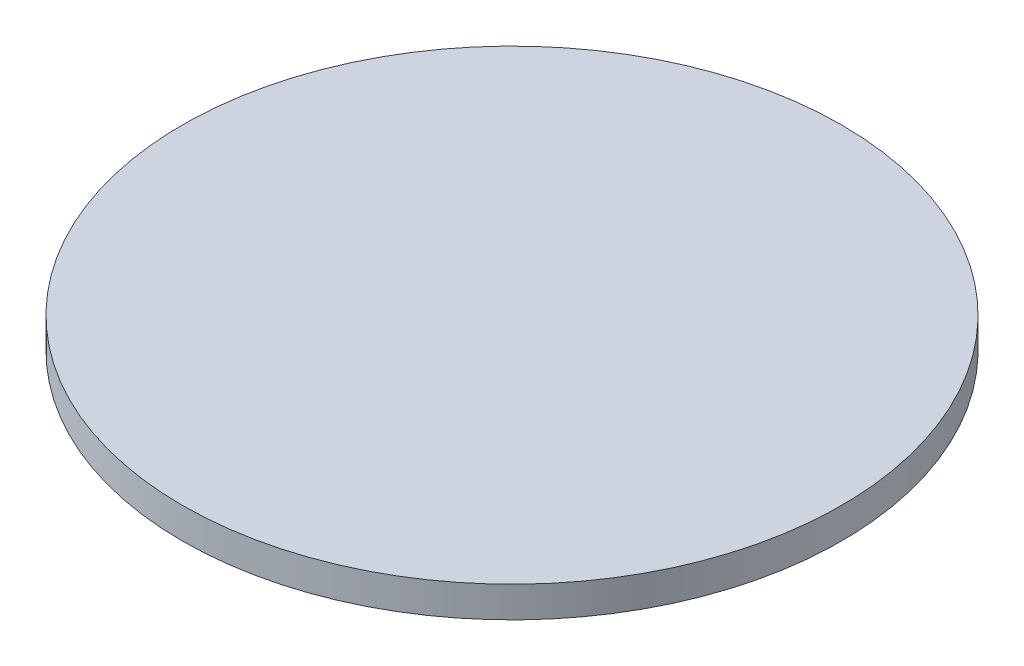
ISO-10303-21;
HEADER;
FILE_DESCRIPTION(('STEP AP214'),'2;1');
FILE_NAME('part.step','',(''),(''),'','','');
FILE_SCHEMA(('AUTOMOTIVE_DESIGN { 1 0 10303 214 1 1 1 1 }'));
ENDSEC;
DATA;
#1=APPLICATION_CONTEXT('core data for automotive mechanical design processes');
#2=APPLICATION_PROTOCOL_DEFINITION('international standard','automotive_design',2000,#1);
#3=PRODUCT_CONTEXT('',#1,'mechanical');
#4=PRODUCT('Part','Part','',(#3));
#5=PRODUCT_RELATED_PRODUCT_CATEGORY('part','',(#4));
#6=PRODUCT_DEFINITION_FORMATION('','',#4);
#7=PRODUCT_DEFINITION_CONTEXT('part definition',#1,'design');
#8=PRODUCT_DEFINITION('design','',#6,#7);
#9=PRODUCT_DEFINITION_SHAPE('','',#8);
#10=(LENGTH_UNIT() NAMED_UNIT(*) SI_UNIT(.MILLI.,.METRE.));
#11=(NAMED_UNIT(*) PLANE_ANGLE_UNIT() SI_UNIT($,.RADIAN.));
#12=(NAMED_UNIT(*) SI_UNIT($,.STERADIAN.) SOLID_ANGLE_UNIT());
#13=UNCERTAINTY_MEASURE_WITH_UNIT(LENGTH_MEASURE(1.E-05),#10,'distance_accuracy_value','');
#14=(GEOMETRIC_REPRESENTATION_CONTEXT(3) GLOBAL_UNCERTAINTY_ASSIGNED_CONTEXT((#13)) GLOBAL_UNIT_ASSIGNED_CONTEXT((#10,
#11,#12)) REPRESENTATION_CONTEXT('',''));
#15=CARTESIAN_POINT('',(0.,0.,0.));
#16=DIRECTION('',(0.,0.,1.));
#17=DIRECTION('',(1.,0.,0.));
#18=AXIS2_PLACEMENT_3D('',#15,#16,#17);
#19=CARTESIAN_POINT('',(8.81554645205922,3.,-5.82946180261568));
#20=DIRECTION('',(0.,-1.,0.));
#21=DIRECTION('',(0.,0.,-1.));
#22=AXIS2_PLACEMENT_3D('',#19,#20,#21);
#23=CYLINDRICAL_SURFACE('',#22,32.);
#24=CARTESIAN_POINT('',(8.81554645205922,3.,-5.82946180261568));
#25=DIRECTION('',(0.,1.,0.));
#26=DIRECTION('',(0.,0.,1.));
#27=AXIS2_PLACEMENT_3D('',#24,#25,#26);
#28=CIRCLE('',#27,32.);
#29=CARTESIAN_POINT('',(8.81554645205922,3.,26.1705381973843));
#30=VERTEX_POINT('',#29);
#31=EDGE_CURVE('E10',#30,#30,#28,.T.);
#32=ORIENTED_EDGE('',*,*,#31,.F.);
#33=EDGE_LOOP('',(#32));
#34=FACE_BOUND('',#33,.T.);
#35=CARTESIAN_POINT('',(8.81554645205922,0.,-5.82946180261568));
#36=DIRECTION('',(0.,1.,0.));
#37=DIRECTION('',(0.,0.,1.));
#38=AXIS2_PLACEMENT_3D('',#35,#36,#37);
#39=CIRCLE('',#38,32.);
#40=CARTESIAN_POINT('',(8.81554645205922,0.,26.1705381973843));
#41=VERTEX_POINT('',#40);
#42=EDGE_CURVE('E40',#41,#41,#39,.T.);
#43=ORIENTED_EDGE('',*,*,#42,.T.);
#44=EDGE_LOOP('',(#43));
#45=FACE_BOUND('',#44,.T.);
#46=ADVANCED_FACE('F37',(#34,#45),#23,.T.);
#47=CARTESIAN_POINT('',(8.81554645205922,3.,-5.82946180261568));
#48=DIRECTION('',(0.,1.,0.));
#49=DIRECTION('',(0.,0.,1.));
#50=AXIS2_PLACEMENT_3D('',#47,#48,#49);
#51=PLANE('',#50);
#52=ORIENTED_EDGE('',*,*,#31,.T.);
#53=EDGE_LOOP('',(#52));
#54=FACE_BOUND('',#53,.T.);
#55=ADVANCED_FACE('F54',(#54),#51,.T.);
#56=CARTESIAN_POINT('',(8.81554645205922,0.,-5.82946180261568));
#57=DIRECTION('',(0.,1.,0.));
#58=DIRECTION('',(0.,0.,1.));
#59=AXIS2_PLACEMENT_3D('',#56,#57,#58);
#60=PLANE('',#59);
#61=ORIENTED_EDGE('',*,*,#42,.F.);
#62=EDGE_LOOP('',(#61));
#63=FACE_BOUND('',#62,.T.);
#64=ADVANCED_FACE('F52',(#63),#60,.F.);
#65=CLOSED_SHELL('',(#46,#55,#64));
#66=MANIFOLD_SOLID_BREP('B2',#65);
#67=ADVANCED_BREP_SHAPE_REPRESENTATION('',(#18,#66),#14);
#68=SHAPE_DEFINITION_REPRESENTATION(#9,#67);
ENDSEC;
END-ISO-10303-21;
